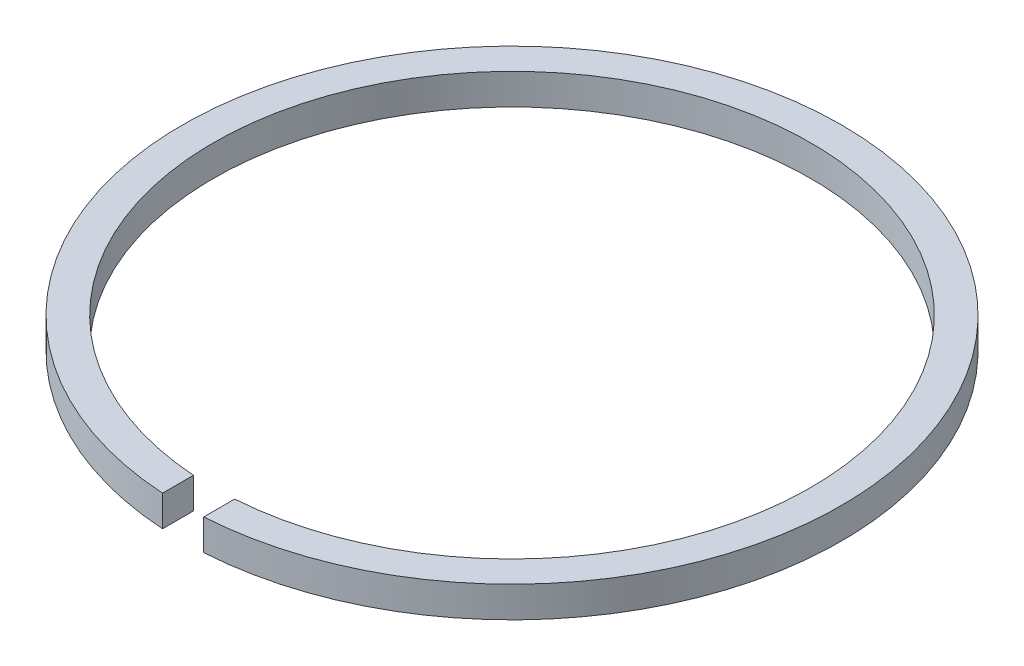
ISO-10303-21;
HEADER;
FILE_DESCRIPTION(('STEP AP214'),'2;1');
FILE_NAME('part.step','',(''),(''),'','','');
FILE_SCHEMA(('AUTOMOTIVE_DESIGN { 1 0 10303 214 1 1 1 1 }'));
ENDSEC;
DATA;
#1=APPLICATION_CONTEXT('core data for automotive mechanical design processes');
#2=APPLICATION_PROTOCOL_DEFINITION('international standard','automotive_design',2000,#1);
#3=PRODUCT_CONTEXT('',#1,'mechanical');
#4=PRODUCT('Part','Part','',(#3));
#5=PRODUCT_RELATED_PRODUCT_CATEGORY('part','',(#4));
#6=PRODUCT_DEFINITION_FORMATION('','',#4);
#7=PRODUCT_DEFINITION_CONTEXT('part definition',#1,'design');
#8=PRODUCT_DEFINITION('design','',#6,#7);
#9=PRODUCT_DEFINITION_SHAPE('','',#8);
#10=(LENGTH_UNIT() NAMED_UNIT(*) SI_UNIT(.MILLI.,.METRE.));
#11=(NAMED_UNIT(*) PLANE_ANGLE_UNIT() SI_UNIT($,.RADIAN.));
#12=(NAMED_UNIT(*) SI_UNIT($,.STERADIAN.) SOLID_ANGLE_UNIT());
#13=UNCERTAINTY_MEASURE_WITH_UNIT(LENGTH_MEASURE(1.E-05),#10,'distance_accuracy_value','');
#14=(GEOMETRIC_REPRESENTATION_CONTEXT(3) GLOBAL_UNCERTAINTY_ASSIGNED_CONTEXT((#13)) GLOBAL_UNIT_ASSIGNED_CONTEXT((#10,
#11,#12)) REPRESENTATION_CONTEXT('',''));
#15=CARTESIAN_POINT('',(0.,0.,0.));
#16=DIRECTION('',(0.,0.,1.));
#17=DIRECTION('',(1.,0.,0.));
#18=AXIS2_PLACEMENT_3D('',#15,#16,#17);
#19=CARTESIAN_POINT('',(0.,0.75,0.));
#20=DIRECTION('',(0.,-1.,0.));
#21=DIRECTION('',(0.,0.,-1.));
#22=AXIS2_PLACEMENT_3D('',#19,#20,#21);
#23=CYLINDRICAL_SURFACE('',#22,16.);
#24=CARTESIAN_POINT('',(0.,-0.75,0.));
#25=DIRECTION('',(0.,1.,0.));
#26=DIRECTION('',(0.,0.,-1.));
#27=AXIS2_PLACEMENT_3D('',#24,#25,#26);
#28=CIRCLE('',#27,16.);
#29=CARTESIAN_POINT('',(1.,-0.75,15.9687194226713));
#30=VERTEX_POINT('',#29);
#31=CARTESIAN_POINT('',(-1.,-0.75,15.9687194226713));
#32=VERTEX_POINT('',#31);
#33=EDGE_CURVE('E107',#30,#32,#28,.T.);
#34=ORIENTED_EDGE('',*,*,#33,.T.);
#35=DIRECTION('',(0.,-1.,0.));
#36=VECTOR('',#35,1.);
#37=CARTESIAN_POINT('',(-1.,0.75,15.9687194226713));
#38=LINE('',#37,#36);
#39=CARTESIAN_POINT('',(-1.,0.75,15.9687194226713));
#40=VERTEX_POINT('',#39);
#41=EDGE_CURVE('E11',#40,#32,#38,.T.);
#42=ORIENTED_EDGE('',*,*,#41,.F.);
#43=CARTESIAN_POINT('',(0.,0.75,0.));
#44=DIRECTION('',(0.,1.,0.));
#45=DIRECTION('',(0.,0.,-1.));
#46=AXIS2_PLACEMENT_3D('',#43,#44,#45);
#47=CIRCLE('',#46,16.);
#48=CARTESIAN_POINT('',(1.,0.75,15.9687194226713));
#49=VERTEX_POINT('',#48);
#50=EDGE_CURVE('E91',#49,#40,#47,.T.);
#51=ORIENTED_EDGE('',*,*,#50,.F.);
#52=DIRECTION('',(0.,-1.,0.));
#53=VECTOR('',#52,1.);
#54=CARTESIAN_POINT('',(1.,0.75,15.9687194226713));
#55=LINE('',#54,#53);
#56=EDGE_CURVE('E103',#49,#30,#55,.T.);
#57=ORIENTED_EDGE('',*,*,#56,.T.);
#58=EDGE_LOOP('',(#34,#42,#51,#57));
#59=FACE_BOUND('',#58,.T.);
#60=ADVANCED_FACE('F39',(#59),#23,.T.);
#61=CARTESIAN_POINT('',(-1.,0.75,15.9687194226713));
#62=DIRECTION('',(-1.,0.,0.));
#63=DIRECTION('',(0.,0.,1.));
#64=AXIS2_PLACEMENT_3D('',#61,#62,#63);
#65=PLANE('',#64);
#66=DIRECTION('',(0.,0.,-1.));
#67=VECTOR('',#66,1.);
#68=CARTESIAN_POINT('',(-1.,-0.75,15.9687194226713));
#69=LINE('',#68,#67);
#70=CARTESIAN_POINT('',(-1.,-0.75,14.4654761414894));
#71=VERTEX_POINT('',#70);
#72=EDGE_CURVE('E96',#32,#71,#69,.T.);
#73=ORIENTED_EDGE('',*,*,#72,.T.);
#74=DIRECTION('',(0.,-1.,0.));
#75=VECTOR('',#74,1.);
#76=CARTESIAN_POINT('',(-1.,0.75,14.4654761414894));
#77=LINE('',#76,#75);
#78=CARTESIAN_POINT('',(-1.,0.75,14.4654761414894));
#79=VERTEX_POINT('',#78);
#80=EDGE_CURVE('E48',#79,#71,#77,.T.);
#81=ORIENTED_EDGE('',*,*,#80,.F.);
#82=DIRECTION('',(0.,0.,-1.));
#83=VECTOR('',#82,1.);
#84=CARTESIAN_POINT('',(-1.,0.75,15.9687194226713));
#85=LINE('',#84,#83);
#86=EDGE_CURVE('E86',#40,#79,#85,.T.);
#87=ORIENTED_EDGE('',*,*,#86,.F.);
#88=ORIENTED_EDGE('',*,*,#41,.T.);
#89=EDGE_LOOP('',(#73,#81,#87,#88));
#90=FACE_BOUND('',#89,.T.);
#91=ADVANCED_FACE('F95',(#90),#65,.F.);
#92=CARTESIAN_POINT('',(0.,0.75,0.));
#93=DIRECTION('',(0.,-1.,0.));
#94=DIRECTION('',(0.,0.,-1.));
#95=AXIS2_PLACEMENT_3D('',#92,#93,#94);
#96=CYLINDRICAL_SURFACE('',#95,14.5);
#97=CARTESIAN_POINT('',(0.,-0.75,0.));
#98=DIRECTION('',(0.,-1.,0.));
#99=DIRECTION('',(0.,0.,1.));
#100=AXIS2_PLACEMENT_3D('',#97,#98,#99);
#101=CIRCLE('',#100,14.5);
#102=CARTESIAN_POINT('',(1.,-0.75,14.4654761414894));
#103=VERTEX_POINT('',#102);
#104=EDGE_CURVE('E73',#71,#103,#101,.T.);
#105=ORIENTED_EDGE('',*,*,#104,.T.);
#106=DIRECTION('',(0.,-1.,0.));
#107=VECTOR('',#106,1.);
#108=CARTESIAN_POINT('',(1.,0.75,14.4654761414894));
#109=LINE('',#108,#107);
#110=CARTESIAN_POINT('',(1.,0.75,14.4654761414894));
#111=VERTEX_POINT('',#110);
#112=EDGE_CURVE('E98',#111,#103,#109,.T.);
#113=ORIENTED_EDGE('',*,*,#112,.F.);
#114=CARTESIAN_POINT('',(0.,0.75,0.));
#115=DIRECTION('',(0.,-1.,0.));
#116=DIRECTION('',(0.,0.,1.));
#117=AXIS2_PLACEMENT_3D('',#114,#115,#116);
#118=CIRCLE('',#117,14.5);
#119=EDGE_CURVE('E89',#79,#111,#118,.T.);
#120=ORIENTED_EDGE('',*,*,#119,.F.);
#121=ORIENTED_EDGE('',*,*,#80,.T.);
#122=EDGE_LOOP('',(#105,#113,#120,#121));
#123=FACE_BOUND('',#122,.T.);
#124=ADVANCED_FACE('F99',(#123),#96,.F.);
#125=CARTESIAN_POINT('',(1.,0.75,15.9687194226713));
#126=DIRECTION('',(1.,0.,0.));
#127=DIRECTION('',(0.,0.,-1.));
#128=AXIS2_PLACEMENT_3D('',#125,#126,#127);
#129=PLANE('',#128);
#130=DIRECTION('',(0.,0.,1.));
#131=VECTOR('',#130,1.);
#132=CARTESIAN_POINT('',(1.,-0.75,15.9687194226713));
#133=LINE('',#132,#131);
#134=EDGE_CURVE('E79',#103,#30,#133,.T.);
#135=ORIENTED_EDGE('',*,*,#134,.T.);
#136=ORIENTED_EDGE('',*,*,#56,.F.);
#137=DIRECTION('',(0.,0.,1.));
#138=VECTOR('',#137,1.);
#139=CARTESIAN_POINT('',(1.,0.75,15.9687194226713));
#140=LINE('',#139,#138);
#141=EDGE_CURVE('E56',#111,#49,#140,.T.);
#142=ORIENTED_EDGE('',*,*,#141,.F.);
#143=ORIENTED_EDGE('',*,*,#112,.T.);
#144=EDGE_LOOP('',(#135,#136,#142,#143));
#145=FACE_BOUND('',#144,.T.);
#146=ADVANCED_FACE('F120',(#145),#129,.F.);
#147=CARTESIAN_POINT('',(0.,0.75,0.));
#148=DIRECTION('',(0.,-1.,0.));
#149=DIRECTION('',(0.,0.,-1.));
#150=AXIS2_PLACEMENT_3D('',#147,#148,#149);
#151=PLANE('',#150);
#152=ORIENTED_EDGE('',*,*,#50,.T.);
#153=ORIENTED_EDGE('',*,*,#86,.T.);
#154=ORIENTED_EDGE('',*,*,#119,.T.);
#155=ORIENTED_EDGE('',*,*,#141,.T.);
#156=EDGE_LOOP('',(#152,#153,#154,#155));
#157=FACE_BOUND('',#156,.T.);
#158=ADVANCED_FACE('F87',(#157),#151,.F.);
#159=CARTESIAN_POINT('',(0.,-0.75,0.));
#160=DIRECTION('',(0.,-1.,0.));
#161=DIRECTION('',(0.,0.,-1.));
#162=AXIS2_PLACEMENT_3D('',#159,#160,#161);
#163=PLANE('',#162);
#164=ORIENTED_EDGE('',*,*,#33,.F.);
#165=ORIENTED_EDGE('',*,*,#134,.F.);
#166=ORIENTED_EDGE('',*,*,#104,.F.);
#167=ORIENTED_EDGE('',*,*,#72,.F.);
#168=EDGE_LOOP('',(#164,#165,#166,#167));
#169=FACE_BOUND('',#168,.T.);
#170=ADVANCED_FACE('F123',(#169),#163,.T.);
#171=CLOSED_SHELL('',(#60,#91,#124,#146,#158,#170));
#172=MANIFOLD_SOLID_BREP('B2',#171);
#173=ADVANCED_BREP_SHAPE_REPRESENTATION('',(#18,#172),#14);
#174=SHAPE_DEFINITION_REPRESENTATION(#9,#173);
ENDSEC;
END-ISO-10303-21;
